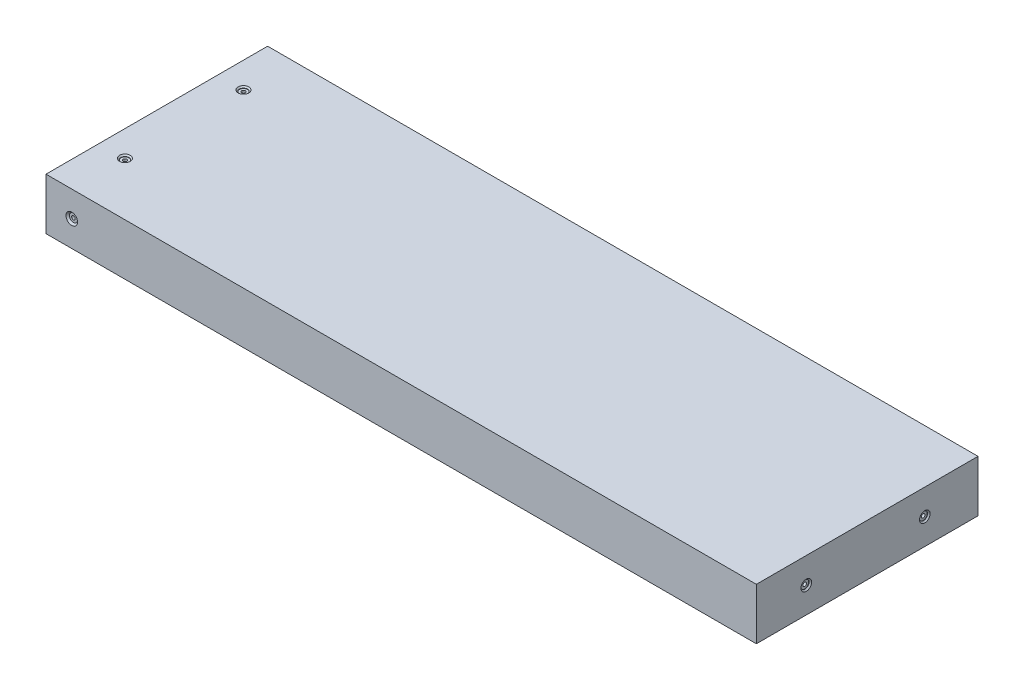
ISO-10303-21;
HEADER;
FILE_DESCRIPTION(('STEP AP214'),'2;1');
FILE_NAME('part.step','',(''),(''),'','','');
FILE_SCHEMA(('AUTOMOTIVE_DESIGN { 1 0 10303 214 1 1 1 1 }'));
ENDSEC;
DATA;
#1=APPLICATION_CONTEXT('core data for automotive mechanical design processes');
#2=APPLICATION_PROTOCOL_DEFINITION('international standard','automotive_design',2000,#1);
#3=PRODUCT_CONTEXT('',#1,'mechanical');
#4=PRODUCT('Part','Part','',(#3));
#5=PRODUCT_RELATED_PRODUCT_CATEGORY('part','',(#4));
#6=PRODUCT_DEFINITION_FORMATION('','',#4);
#7=PRODUCT_DEFINITION_CONTEXT('part definition',#1,'design');
#8=PRODUCT_DEFINITION('design','',#6,#7);
#9=PRODUCT_DEFINITION_SHAPE('','',#8);
#10=(LENGTH_UNIT() NAMED_UNIT(*) SI_UNIT(.MILLI.,.METRE.));
#11=(NAMED_UNIT(*) PLANE_ANGLE_UNIT() SI_UNIT($,.RADIAN.));
#12=(NAMED_UNIT(*) SI_UNIT($,.STERADIAN.) SOLID_ANGLE_UNIT());
#13=UNCERTAINTY_MEASURE_WITH_UNIT(LENGTH_MEASURE(1.E-05),#10,'distance_accuracy_value','');
#14=(GEOMETRIC_REPRESENTATION_CONTEXT(3) GLOBAL_UNCERTAINTY_ASSIGNED_CONTEXT((#13)) GLOBAL_UNIT_ASSIGNED_CONTEXT((#10,
#11,#12)) REPRESENTATION_CONTEXT('',''));
#15=CARTESIAN_POINT('',(0.,0.,0.));
#16=DIRECTION('',(0.,0.,1.));
#17=DIRECTION('',(1.,0.,0.));
#18=AXIS2_PLACEMENT_3D('',#15,#16,#17);
#19=CARTESIAN_POINT('',(-162.3,12.7,-54.6));
#20=DIRECTION('',(0.,0.,-1.));
#21=DIRECTION('',(-1.,0.,0.));
#22=AXIS2_PLACEMENT_3D('',#19,#20,#21);
#23=CYLINDRICAL_SURFACE('',#22,0.889000000000001);
#24=CARTESIAN_POINT('',(-162.3,12.7,-53.7872));
#25=DIRECTION('',(0.,0.,-1.));
#26=DIRECTION('',(-1.,0.,0.));
#27=AXIS2_PLACEMENT_3D('',#24,#25,#26);
#28=CIRCLE('',#27,0.889000000000001);
#29=CARTESIAN_POINT('',(-163.189,12.7,-53.7872));
#30=VERTEX_POINT('',#29);
#31=EDGE_CURVE('E169',#30,#30,#28,.T.);
#32=ORIENTED_EDGE('',*,*,#31,.T.);
#33=EDGE_LOOP('',(#32));
#34=FACE_BOUND('',#33,.T.);
#35=CARTESIAN_POINT('',(-162.3,12.7,-30.));
#36=DIRECTION('',(0.,-0.707106781186547,-0.707106781186547));
#37=DIRECTION('',(0.,0.707106781186547,-0.707106781186547));
#38=AXIS2_PLACEMENT_3D('',#35,#36,#37);
#39=ELLIPSE('',#38,1.25723585694968,0.889000000000001);
#40=CARTESIAN_POINT('',(-161.411,12.7,-30.));
#41=VERTEX_POINT('',#40);
#42=CARTESIAN_POINT('',(-163.189,12.7,-30.));
#43=VERTEX_POINT('',#42);
#44=EDGE_CURVE('E47',#41,#43,#39,.F.);
#45=ORIENTED_EDGE('',*,*,#44,.T.);
#46=CARTESIAN_POINT('',(-162.3,12.7,-30.));
#47=DIRECTION('',(0.,0.707106781186547,-0.707106781186547));
#48=DIRECTION('',(0.,-0.707106781186547,-0.707106781186547));
#49=AXIS2_PLACEMENT_3D('',#46,#47,#48);
#50=ELLIPSE('',#49,1.25723585694968,0.889000000000001);
#51=EDGE_CURVE('E11',#43,#41,#50,.F.);
#52=ORIENTED_EDGE('',*,*,#51,.T.);
#53=EDGE_LOOP('',(#45,#52));
#54=FACE_BOUND('',#53,.T.);
#55=ADVANCED_FACE('F34',(#34,#54),#23,.F.);
#56=CARTESIAN_POINT('',(-162.3,12.7,54.6));
#57=DIRECTION('',(0.,0.,1.));
#58=DIRECTION('',(1.,0.,0.));
#59=AXIS2_PLACEMENT_3D('',#56,#57,#58);
#60=CYLINDRICAL_SURFACE('',#59,0.889000000000001);
#61=CARTESIAN_POINT('',(-162.3,12.7,53.7872));
#62=DIRECTION('',(0.,0.,1.));
#63=DIRECTION('',(1.,0.,0.));
#64=AXIS2_PLACEMENT_3D('',#61,#62,#63);
#65=CIRCLE('',#64,0.889000000000001);
#66=CARTESIAN_POINT('',(-161.411,12.7,53.7872));
#67=VERTEX_POINT('',#66);
#68=EDGE_CURVE('E154',#67,#67,#65,.T.);
#69=ORIENTED_EDGE('',*,*,#68,.T.);
#70=EDGE_LOOP('',(#69));
#71=FACE_BOUND('',#70,.T.);
#72=CARTESIAN_POINT('',(-162.3,12.7,28.4));
#73=DIRECTION('',(0.,-0.707106781186547,0.707106781186547));
#74=DIRECTION('',(0.,0.707106781186547,0.707106781186547));
#75=AXIS2_PLACEMENT_3D('',#72,#73,#74);
#76=ELLIPSE('',#75,1.25723585694968,0.889000000000001);
#77=CARTESIAN_POINT('',(-163.189,12.7,28.4));
#78=VERTEX_POINT('',#77);
#79=CARTESIAN_POINT('',(-161.411,12.7,28.4));
#80=VERTEX_POINT('',#79);
#81=EDGE_CURVE('E54',#78,#80,#76,.F.);
#82=ORIENTED_EDGE('',*,*,#81,.T.);
#83=CARTESIAN_POINT('',(-162.3,12.7,28.4));
#84=DIRECTION('',(0.,0.707106781186547,0.707106781186547));
#85=DIRECTION('',(0.,-0.707106781186547,0.707106781186547));
#86=AXIS2_PLACEMENT_3D('',#83,#84,#85);
#87=ELLIPSE('',#86,1.25723585694968,0.889000000000001);
#88=EDGE_CURVE('E108',#80,#78,#87,.F.);
#89=ORIENTED_EDGE('',*,*,#88,.T.);
#90=EDGE_LOOP('',(#82,#89));
#91=FACE_BOUND('',#90,.T.);
#92=ADVANCED_FACE('F282',(#71,#91),#60,.F.);
#93=CARTESIAN_POINT('',(175.,25.4,-54.6));
#94=DIRECTION('',(-1.,0.,0.));
#95=DIRECTION('',(0.,0.,1.));
#96=AXIS2_PLACEMENT_3D('',#93,#94,#95);
#97=PLANE('',#96);
#98=CARTESIAN_POINT('',(175.,12.7,30.));
#99=DIRECTION('',(1.,0.,0.));
#100=DIRECTION('',(0.,0.,-1.));
#101=AXIS2_PLACEMENT_3D('',#98,#99,#100);
#102=CIRCLE('',#101,2.62001);
#103=CARTESIAN_POINT('',(175.,12.7,27.37999));
#104=VERTEX_POINT('',#103);
#105=EDGE_CURVE('E208',#104,#104,#102,.T.);
#106=ORIENTED_EDGE('',*,*,#105,.F.);
#107=EDGE_LOOP('',(#106));
#108=FACE_BOUND('',#107,.T.);
#109=CARTESIAN_POINT('',(175.,12.7,-28.4));
#110=DIRECTION('',(1.,0.,0.));
#111=DIRECTION('',(0.,0.,-1.));
#112=AXIS2_PLACEMENT_3D('',#109,#110,#111);
#113=CIRCLE('',#112,2.62001);
#114=CARTESIAN_POINT('',(175.,12.7,-31.02001));
#115=VERTEX_POINT('',#114);
#116=EDGE_CURVE('E193',#115,#115,#113,.T.);
#117=ORIENTED_EDGE('',*,*,#116,.F.);
#118=EDGE_LOOP('',(#117));
#119=FACE_BOUND('',#118,.T.);
#120=DIRECTION('',(0.,0.,-1.));
#121=VECTOR('',#120,1.);
#122=CARTESIAN_POINT('',(175.,0.,-54.6));
#123=LINE('',#122,#121);
#124=CARTESIAN_POINT('',(175.,0.,54.6));
#125=VERTEX_POINT('',#124);
#126=CARTESIAN_POINT('',(175.,0.,-54.6));
#127=VERTEX_POINT('',#126);
#128=EDGE_CURVE('E141',#125,#127,#123,.T.);
#129=ORIENTED_EDGE('',*,*,#128,.T.);
#130=DIRECTION('',(0.,-1.,0.));
#131=VECTOR('',#130,1.);
#132=CARTESIAN_POINT('',(175.,25.4,-54.6));
#133=LINE('',#132,#131);
#134=CARTESIAN_POINT('',(175.,25.4,-54.6));
#135=VERTEX_POINT('',#134);
#136=EDGE_CURVE('E121',#135,#127,#133,.T.);
#137=ORIENTED_EDGE('',*,*,#136,.F.);
#138=DIRECTION('',(0.,0.,-1.));
#139=VECTOR('',#138,1.);
#140=CARTESIAN_POINT('',(175.,25.4,-54.6));
#141=LINE('',#140,#139);
#142=CARTESIAN_POINT('',(175.,25.4,54.6));
#143=VERTEX_POINT('',#142);
#144=EDGE_CURVE('E136',#143,#135,#141,.T.);
#145=ORIENTED_EDGE('',*,*,#144,.F.);
#146=DIRECTION('',(0.,-1.,0.));
#147=VECTOR('',#146,1.);
#148=CARTESIAN_POINT('',(175.,25.4,54.6));
#149=LINE('',#148,#147);
#150=EDGE_CURVE('E130',#143,#125,#149,.T.);
#151=ORIENTED_EDGE('',*,*,#150,.T.);
#152=EDGE_LOOP('',(#129,#137,#145,#151));
#153=FACE_BOUND('',#152,.T.);
#154=ADVANCED_FACE('F36',(#108,#119,#153),#97,.F.);
#155=CARTESIAN_POINT('',(-175.,25.4,-54.6));
#156=DIRECTION('',(0.,0.,1.));
#157=DIRECTION('',(1.,0.,0.));
#158=AXIS2_PLACEMENT_3D('',#155,#156,#157);
#159=PLANE('',#158);
#160=CARTESIAN_POINT('',(-162.3,12.7,-54.6));
#161=DIRECTION('',(0.,0.,-1.));
#162=DIRECTION('',(-1.,0.,0.));
#163=AXIS2_PLACEMENT_3D('',#160,#161,#162);
#164=CIRCLE('',#163,2.85749999999998);
#165=CARTESIAN_POINT('',(-165.1575,12.7,-54.6));
#166=VERTEX_POINT('',#165);
#167=EDGE_CURVE('E178',#166,#166,#164,.T.);
#168=ORIENTED_EDGE('',*,*,#167,.F.);
#169=EDGE_LOOP('',(#168));
#170=FACE_BOUND('',#169,.T.);
#171=DIRECTION('',(-1.,0.,0.));
#172=VECTOR('',#171,1.);
#173=CARTESIAN_POINT('',(-175.,0.,-54.6));
#174=LINE('',#173,#172);
#175=CARTESIAN_POINT('',(-175.,0.,-54.6));
#176=VERTEX_POINT('',#175);
#177=EDGE_CURVE('E139',#127,#176,#174,.T.);
#178=ORIENTED_EDGE('',*,*,#177,.T.);
#179=DIRECTION('',(0.,-1.,0.));
#180=VECTOR('',#179,1.);
#181=CARTESIAN_POINT('',(-175.,25.4,-54.6));
#182=LINE('',#181,#180);
#183=CARTESIAN_POINT('',(-175.,25.4,-54.6));
#184=VERTEX_POINT('',#183);
#185=EDGE_CURVE('E124',#184,#176,#182,.T.);
#186=ORIENTED_EDGE('',*,*,#185,.F.);
#187=DIRECTION('',(-1.,0.,0.));
#188=VECTOR('',#187,1.);
#189=CARTESIAN_POINT('',(-175.,25.4,-54.6));
#190=LINE('',#189,#188);
#191=EDGE_CURVE('E148',#135,#184,#190,.T.);
#192=ORIENTED_EDGE('',*,*,#191,.F.);
#193=ORIENTED_EDGE('',*,*,#136,.T.);
#194=EDGE_LOOP('',(#178,#186,#192,#193));
#195=FACE_BOUND('',#194,.T.);
#196=ADVANCED_FACE('F260',(#170,#195),#159,.F.);
#197=CARTESIAN_POINT('',(-175.,25.4,-54.6));
#198=DIRECTION('',(1.,0.,0.));
#199=DIRECTION('',(0.,0.,-1.));
#200=AXIS2_PLACEMENT_3D('',#197,#198,#199);
#201=PLANE('',#200);
#202=DIRECTION('',(0.,0.,1.));
#203=VECTOR('',#202,1.);
#204=CARTESIAN_POINT('',(-175.,0.,-54.6));
#205=LINE('',#204,#203);
#206=CARTESIAN_POINT('',(-175.,0.,54.6));
#207=VERTEX_POINT('',#206);
#208=EDGE_CURVE('E137',#176,#207,#205,.T.);
#209=ORIENTED_EDGE('',*,*,#208,.T.);
#210=DIRECTION('',(0.,-1.,0.));
#211=VECTOR('',#210,1.);
#212=CARTESIAN_POINT('',(-175.,25.4,54.6));
#213=LINE('',#212,#211);
#214=CARTESIAN_POINT('',(-175.,25.4,54.6));
#215=VERTEX_POINT('',#214);
#216=EDGE_CURVE('E127',#215,#207,#213,.T.);
#217=ORIENTED_EDGE('',*,*,#216,.F.);
#218=DIRECTION('',(0.,0.,1.));
#219=VECTOR('',#218,1.);
#220=CARTESIAN_POINT('',(-175.,25.4,-54.6));
#221=LINE('',#220,#219);
#222=EDGE_CURVE('E146',#184,#215,#221,.T.);
#223=ORIENTED_EDGE('',*,*,#222,.F.);
#224=ORIENTED_EDGE('',*,*,#185,.T.);
#225=EDGE_LOOP('',(#209,#217,#223,#224));
#226=FACE_BOUND('',#225,.T.);
#227=ADVANCED_FACE('F265',(#226),#201,.F.);
#228=CARTESIAN_POINT('',(-175.,25.4,54.6));
#229=DIRECTION('',(0.,0.,-1.));
#230=DIRECTION('',(-1.,0.,0.));
#231=AXIS2_PLACEMENT_3D('',#228,#229,#230);
#232=PLANE('',#231);
#233=CARTESIAN_POINT('',(-162.3,12.7,54.6));
#234=DIRECTION('',(0.,0.,1.));
#235=DIRECTION('',(1.,0.,0.));
#236=AXIS2_PLACEMENT_3D('',#233,#234,#235);
#237=CIRCLE('',#236,2.85749999999998);
#238=CARTESIAN_POINT('',(-159.4425,12.7,54.6));
#239=VERTEX_POINT('',#238);
#240=EDGE_CURVE('E163',#239,#239,#237,.T.);
#241=ORIENTED_EDGE('',*,*,#240,.F.);
#242=EDGE_LOOP('',(#241));
#243=FACE_BOUND('',#242,.T.);
#244=DIRECTION('',(1.,0.,0.));
#245=VECTOR('',#244,1.);
#246=CARTESIAN_POINT('',(-175.,0.,54.6));
#247=LINE('',#246,#245);
#248=EDGE_CURVE('E134',#207,#125,#247,.T.);
#249=ORIENTED_EDGE('',*,*,#248,.T.);
#250=ORIENTED_EDGE('',*,*,#150,.F.);
#251=DIRECTION('',(1.,0.,0.));
#252=VECTOR('',#251,1.);
#253=CARTESIAN_POINT('',(-175.,25.4,54.6));
#254=LINE('',#253,#252);
#255=EDGE_CURVE('E133',#215,#143,#254,.T.);
#256=ORIENTED_EDGE('',*,*,#255,.F.);
#257=ORIENTED_EDGE('',*,*,#216,.T.);
#258=EDGE_LOOP('',(#249,#250,#256,#257));
#259=FACE_BOUND('',#258,.T.);
#260=ADVANCED_FACE('F248',(#243,#259),#232,.F.);
#261=CARTESIAN_POINT('',(0.,25.4,0.));
#262=DIRECTION('',(0.,1.,0.));
#263=DIRECTION('',(0.,0.,1.));
#264=AXIS2_PLACEMENT_3D('',#261,#262,#263);
#265=PLANE('',#264);
#266=CARTESIAN_POINT('',(-162.3,25.4,-30.));
#267=DIRECTION('',(0.,1.,0.));
#268=DIRECTION('',(0.,0.,1.));
#269=AXIS2_PLACEMENT_3D('',#266,#267,#268);
#270=CIRCLE('',#269,2.62001000000001);
#271=CARTESIAN_POINT('',(-162.3,25.4,-27.37999));
#272=VERTEX_POINT('',#271);
#273=EDGE_CURVE('E238',#272,#272,#270,.T.);
#274=ORIENTED_EDGE('',*,*,#273,.F.);
#275=EDGE_LOOP('',(#274));
#276=FACE_BOUND('',#275,.T.);
#277=CARTESIAN_POINT('',(-162.3,25.4,28.4));
#278=DIRECTION('',(0.,1.,0.));
#279=DIRECTION('',(0.,0.,1.));
#280=AXIS2_PLACEMENT_3D('',#277,#278,#279);
#281=CIRCLE('',#280,2.62001000000001);
#282=CARTESIAN_POINT('',(-162.3,25.4,31.02001));
#283=VERTEX_POINT('',#282);
#284=EDGE_CURVE('E223',#283,#283,#281,.T.);
#285=ORIENTED_EDGE('',*,*,#284,.F.);
#286=EDGE_LOOP('',(#285));
#287=FACE_BOUND('',#286,.T.);
#288=ORIENTED_EDGE('',*,*,#144,.T.);
#289=ORIENTED_EDGE('',*,*,#191,.T.);
#290=ORIENTED_EDGE('',*,*,#222,.T.);
#291=ORIENTED_EDGE('',*,*,#255,.T.);
#292=EDGE_LOOP('',(#288,#289,#290,#291));
#293=FACE_BOUND('',#292,.T.);
#294=ADVANCED_FACE('F244',(#276,#287,#293),#265,.T.);
#295=CARTESIAN_POINT('',(0.,0.,0.));
#296=DIRECTION('',(0.,1.,0.));
#297=DIRECTION('',(0.,0.,1.));
#298=AXIS2_PLACEMENT_3D('',#295,#296,#297);
#299=PLANE('',#298);
#300=CARTESIAN_POINT('',(-162.3,0.,-30.));
#301=DIRECTION('',(0.,1.,0.));
#302=DIRECTION('',(0.,0.,1.));
#303=AXIS2_PLACEMENT_3D('',#300,#301,#302);
#304=CIRCLE('',#303,0.889000000000001);
#305=CARTESIAN_POINT('',(-162.3,0.,-29.111));
#306=VERTEX_POINT('',#305);
#307=EDGE_CURVE('E226',#306,#306,#304,.T.);
#308=ORIENTED_EDGE('',*,*,#307,.T.);
#309=EDGE_LOOP('',(#308));
#310=FACE_BOUND('',#309,.T.);
#311=CARTESIAN_POINT('',(-162.3,0.,28.4));
#312=DIRECTION('',(0.,1.,0.));
#313=DIRECTION('',(0.,0.,1.));
#314=AXIS2_PLACEMENT_3D('',#311,#312,#313);
#315=CIRCLE('',#314,0.889000000000001);
#316=CARTESIAN_POINT('',(-162.3,0.,29.289));
#317=VERTEX_POINT('',#316);
#318=EDGE_CURVE('E211',#317,#317,#315,.T.);
#319=ORIENTED_EDGE('',*,*,#318,.T.);
#320=EDGE_LOOP('',(#319));
#321=FACE_BOUND('',#320,.T.);
#322=ORIENTED_EDGE('',*,*,#128,.F.);
#323=ORIENTED_EDGE('',*,*,#248,.F.);
#324=ORIENTED_EDGE('',*,*,#208,.F.);
#325=ORIENTED_EDGE('',*,*,#177,.F.);
#326=EDGE_LOOP('',(#322,#323,#324,#325));
#327=FACE_BOUND('',#326,.T.);
#328=ADVANCED_FACE('F247',(#310,#321,#327),#299,.F.);
#329=CARTESIAN_POINT('',(-161.411,12.7,53.7872));
#330=DIRECTION('',(0.,0.,-1.));
#331=DIRECTION('',(-1.,0.,0.));
#332=AXIS2_PLACEMENT_3D('',#329,#330,#331);
#333=PLANE('',#332);
#334=ORIENTED_EDGE('',*,*,#68,.F.);
#335=EDGE_LOOP('',(#334));
#336=FACE_BOUND('',#335,.T.);
#337=CARTESIAN_POINT('',(-162.3,12.7,53.7872));
#338=DIRECTION('',(0.,0.,1.));
#339=DIRECTION('',(1.,0.,0.));
#340=AXIS2_PLACEMENT_3D('',#337,#338,#339);
#341=CIRCLE('',#340,1.98500999999998);
#342=CARTESIAN_POINT('',(-160.31499,12.7,53.7872));
#343=VERTEX_POINT('',#342);
#344=EDGE_CURVE('E157',#343,#343,#341,.T.);
#345=ORIENTED_EDGE('',*,*,#344,.T.);
#346=EDGE_LOOP('',(#345));
#347=FACE_BOUND('',#346,.T.);
#348=ADVANCED_FACE('F270',(#336,#347),#333,.F.);
#349=CARTESIAN_POINT('',(-162.3,12.7,54.6));
#350=DIRECTION('',(0.,0.,1.));
#351=DIRECTION('',(1.,0.,0.));
#352=AXIS2_PLACEMENT_3D('',#349,#350,#351);
#353=CYLINDRICAL_SURFACE('',#352,1.98500999999998);
#354=ORIENTED_EDGE('',*,*,#344,.F.);
#355=EDGE_LOOP('',(#354));
#356=FACE_BOUND('',#355,.T.);
#357=CARTESIAN_POINT('',(-162.3,12.7,53.72751));
#358=DIRECTION('',(0.,0.,1.));
#359=DIRECTION('',(1.,0.,0.));
#360=AXIS2_PLACEMENT_3D('',#357,#358,#359);
#361=CIRCLE('',#360,1.98500999999998);
#362=CARTESIAN_POINT('',(-160.31499,12.7,53.72751));
#363=VERTEX_POINT('',#362);
#364=EDGE_CURVE('E160',#363,#363,#361,.T.);
#365=ORIENTED_EDGE('',*,*,#364,.T.);
#366=EDGE_LOOP('',(#365));
#367=FACE_BOUND('',#366,.T.);
#368=ADVANCED_FACE('F276',(#356,#367),#353,.T.);
#369=CARTESIAN_POINT('',(-162.3,12.7,54.6));
#370=DIRECTION('',(0.,0.,1.));
#371=DIRECTION('',(1.,0.,0.));
#372=AXIS2_PLACEMENT_3D('',#369,#370,#371);
#373=CONICAL_SURFACE('',#372,2.85749999999998,0.785398163397452);
#374=ORIENTED_EDGE('',*,*,#364,.F.);
#375=EDGE_LOOP('',(#374));
#376=FACE_BOUND('',#375,.T.);
#377=ORIENTED_EDGE('',*,*,#240,.T.);
#378=EDGE_LOOP('',(#377));
#379=FACE_BOUND('',#378,.T.);
#380=ADVANCED_FACE('F309',(#376,#379),#373,.F.);
#381=CARTESIAN_POINT('',(-161.411,12.7,-53.7872));
#382=DIRECTION('',(0.,0.,1.));
#383=DIRECTION('',(1.,0.,0.));
#384=AXIS2_PLACEMENT_3D('',#381,#382,#383);
#385=PLANE('',#384);
#386=ORIENTED_EDGE('',*,*,#31,.F.);
#387=EDGE_LOOP('',(#386));
#388=FACE_BOUND('',#387,.T.);
#389=CARTESIAN_POINT('',(-162.3,12.7,-53.7872));
#390=DIRECTION('',(0.,0.,-1.));
#391=DIRECTION('',(-1.,0.,0.));
#392=AXIS2_PLACEMENT_3D('',#389,#390,#391);
#393=CIRCLE('',#392,1.98500999999998);
#394=CARTESIAN_POINT('',(-164.28501,12.7,-53.7872));
#395=VERTEX_POINT('',#394);
#396=EDGE_CURVE('E172',#395,#395,#393,.T.);
#397=ORIENTED_EDGE('',*,*,#396,.T.);
#398=EDGE_LOOP('',(#397));
#399=FACE_BOUND('',#398,.T.);
#400=ADVANCED_FACE('F312',(#388,#399),#385,.F.);
#401=CARTESIAN_POINT('',(-162.3,12.7,-54.6));
#402=DIRECTION('',(0.,0.,-1.));
#403=DIRECTION('',(-1.,0.,0.));
#404=AXIS2_PLACEMENT_3D('',#401,#402,#403);
#405=CYLINDRICAL_SURFACE('',#404,1.98500999999998);
#406=ORIENTED_EDGE('',*,*,#396,.F.);
#407=EDGE_LOOP('',(#406));
#408=FACE_BOUND('',#407,.T.);
#409=CARTESIAN_POINT('',(-162.3,12.7,-53.72751));
#410=DIRECTION('',(0.,0.,-1.));
#411=DIRECTION('',(-1.,0.,0.));
#412=AXIS2_PLACEMENT_3D('',#409,#410,#411);
#413=CIRCLE('',#412,1.98500999999998);
#414=CARTESIAN_POINT('',(-164.28501,12.7,-53.72751));
#415=VERTEX_POINT('',#414);
#416=EDGE_CURVE('E175',#415,#415,#413,.T.);
#417=ORIENTED_EDGE('',*,*,#416,.T.);
#418=EDGE_LOOP('',(#417));
#419=FACE_BOUND('',#418,.T.);
#420=ADVANCED_FACE('F394',(#408,#419),#405,.T.);
#421=CARTESIAN_POINT('',(-162.3,12.7,-54.6));
#422=DIRECTION('',(0.,0.,-1.));
#423=DIRECTION('',(-1.,0.,0.));
#424=AXIS2_PLACEMENT_3D('',#421,#422,#423);
#425=CONICAL_SURFACE('',#424,2.85749999999998,0.785398163397452);
#426=ORIENTED_EDGE('',*,*,#416,.F.);
#427=EDGE_LOOP('',(#426));
#428=FACE_BOUND('',#427,.T.);
#429=ORIENTED_EDGE('',*,*,#167,.T.);
#430=EDGE_LOOP('',(#429));
#431=FACE_BOUND('',#430,.T.);
#432=ADVANCED_FACE('F390',(#428,#431),#425,.F.);
#433=CARTESIAN_POINT('',(145.,12.7,-28.4));
#434=DIRECTION('',(1.,0.,0.));
#435=DIRECTION('',(0.,0.,-1.));
#436=AXIS2_PLACEMENT_3D('',#433,#434,#435);
#437=CONICAL_SURFACE('',#436,0.888999999999992,1.02974425867664);
#438=CARTESIAN_POINT('',(144.465834909684,12.7,-28.4));
#439=VERTEX_POINT('',#438);
#440=VERTEX_LOOP('',#439);
#441=FACE_BOUND('',#440,.T.);
#442=CARTESIAN_POINT('',(145.,12.7,-28.4));
#443=DIRECTION('',(1.,0.,0.));
#444=DIRECTION('',(0.,0.,-1.));
#445=AXIS2_PLACEMENT_3D('',#442,#443,#444);
#446=CIRCLE('',#445,0.888999999999992);
#447=CARTESIAN_POINT('',(145.,12.7,-29.289));
#448=VERTEX_POINT('',#447);
#449=EDGE_CURVE('E181',#448,#448,#446,.T.);
#450=ORIENTED_EDGE('',*,*,#449,.T.);
#451=EDGE_LOOP('',(#450));
#452=FACE_BOUND('',#451,.T.);
#453=ADVANCED_FACE('F386',(#441,#452),#437,.F.);
#454=CARTESIAN_POINT('',(175.,12.7,-28.4));
#455=DIRECTION('',(1.,0.,0.));
#456=DIRECTION('',(0.,0.,-1.));
#457=AXIS2_PLACEMENT_3D('',#454,#455,#456);
#458=CYLINDRICAL_SURFACE('',#457,0.888999999999994);
#459=ORIENTED_EDGE('',*,*,#449,.F.);
#460=EDGE_LOOP('',(#459));
#461=FACE_BOUND('',#460,.T.);
#462=CARTESIAN_POINT('',(174.1872,12.7,-28.4));
#463=DIRECTION('',(1.,0.,0.));
#464=DIRECTION('',(0.,0.,-1.));
#465=AXIS2_PLACEMENT_3D('',#462,#463,#464);
#466=CIRCLE('',#465,0.888999999999996);
#467=CARTESIAN_POINT('',(174.1872,12.7,-29.289));
#468=VERTEX_POINT('',#467);
#469=EDGE_CURVE('E184',#468,#468,#466,.T.);
#470=ORIENTED_EDGE('',*,*,#469,.T.);
#471=EDGE_LOOP('',(#470));
#472=FACE_BOUND('',#471,.T.);
#473=ADVANCED_FACE('F382',(#461,#472),#458,.F.);
#474=CARTESIAN_POINT('',(174.1872,13.589,-28.4));
#475=DIRECTION('',(-1.,0.,0.));
#476=DIRECTION('',(0.,0.,1.));
#477=AXIS2_PLACEMENT_3D('',#474,#475,#476);
#478=PLANE('',#477);
#479=ORIENTED_EDGE('',*,*,#469,.F.);
#480=EDGE_LOOP('',(#479));
#481=FACE_BOUND('',#480,.T.);
#482=CARTESIAN_POINT('',(174.1872,12.7,-28.4));
#483=DIRECTION('',(1.,0.,0.));
#484=DIRECTION('',(0.,0.,-1.));
#485=AXIS2_PLACEMENT_3D('',#482,#483,#484);
#486=CIRCLE('',#485,1.98501);
#487=CARTESIAN_POINT('',(174.1872,12.7,-30.38501));
#488=VERTEX_POINT('',#487);
#489=EDGE_CURVE('E187',#488,#488,#486,.T.);
#490=ORIENTED_EDGE('',*,*,#489,.T.);
#491=EDGE_LOOP('',(#490));
#492=FACE_BOUND('',#491,.T.);
#493=ADVANCED_FACE('F378',(#481,#492),#478,.F.);
#494=CARTESIAN_POINT('',(175.,12.7,-28.4));
#495=DIRECTION('',(1.,0.,0.));
#496=DIRECTION('',(0.,0.,-1.));
#497=AXIS2_PLACEMENT_3D('',#494,#495,#496);
#498=CYLINDRICAL_SURFACE('',#497,1.98501);
#499=ORIENTED_EDGE('',*,*,#489,.F.);
#500=EDGE_LOOP('',(#499));
#501=FACE_BOUND('',#500,.T.);
#502=CARTESIAN_POINT('',(174.365,12.7,-28.4));
#503=DIRECTION('',(1.,0.,0.));
#504=DIRECTION('',(0.,0.,-1.));
#505=AXIS2_PLACEMENT_3D('',#502,#503,#504);
#506=CIRCLE('',#505,1.98501);
#507=CARTESIAN_POINT('',(174.365,12.7,-30.38501));
#508=VERTEX_POINT('',#507);
#509=EDGE_CURVE('E190',#508,#508,#506,.T.);
#510=ORIENTED_EDGE('',*,*,#509,.T.);
#511=EDGE_LOOP('',(#510));
#512=FACE_BOUND('',#511,.T.);
#513=ADVANCED_FACE('F374',(#501,#512),#498,.F.);
#514=CARTESIAN_POINT('',(175.,12.7,-28.4));
#515=DIRECTION('',(1.,0.,0.));
#516=DIRECTION('',(0.,0.,-1.));
#517=AXIS2_PLACEMENT_3D('',#514,#515,#516);
#518=CONICAL_SURFACE('',#517,2.62001,0.785398163397451);
#519=ORIENTED_EDGE('',*,*,#509,.F.);
#520=EDGE_LOOP('',(#519));
#521=FACE_BOUND('',#520,.T.);
#522=ORIENTED_EDGE('',*,*,#116,.T.);
#523=EDGE_LOOP('',(#522));
#524=FACE_BOUND('',#523,.T.);
#525=ADVANCED_FACE('F370',(#521,#524),#518,.F.);
#526=CARTESIAN_POINT('',(145.,12.7,30.));
#527=DIRECTION('',(1.,0.,0.));
#528=DIRECTION('',(0.,0.,-1.));
#529=AXIS2_PLACEMENT_3D('',#526,#527,#528);
#530=CONICAL_SURFACE('',#529,0.888999999999992,1.02974425867664);
#531=CARTESIAN_POINT('',(144.465834909684,12.7,30.));
#532=VERTEX_POINT('',#531);
#533=VERTEX_LOOP('',#532);
#534=FACE_BOUND('',#533,.T.);
#535=CARTESIAN_POINT('',(145.,12.7,30.));
#536=DIRECTION('',(1.,0.,0.));
#537=DIRECTION('',(0.,0.,-1.));
#538=AXIS2_PLACEMENT_3D('',#535,#536,#537);
#539=CIRCLE('',#538,0.888999999999992);
#540=CARTESIAN_POINT('',(145.,12.7,29.111));
#541=VERTEX_POINT('',#540);
#542=EDGE_CURVE('E196',#541,#541,#539,.T.);
#543=ORIENTED_EDGE('',*,*,#542,.T.);
#544=EDGE_LOOP('',(#543));
#545=FACE_BOUND('',#544,.T.);
#546=ADVANCED_FACE('F366',(#534,#545),#530,.F.);
#547=CARTESIAN_POINT('',(175.,12.7,30.));
#548=DIRECTION('',(1.,0.,0.));
#549=DIRECTION('',(0.,0.,-1.));
#550=AXIS2_PLACEMENT_3D('',#547,#548,#549);
#551=CYLINDRICAL_SURFACE('',#550,0.888999999999994);
#552=ORIENTED_EDGE('',*,*,#542,.F.);
#553=EDGE_LOOP('',(#552));
#554=FACE_BOUND('',#553,.T.);
#555=CARTESIAN_POINT('',(174.1872,12.7,30.));
#556=DIRECTION('',(1.,0.,0.));
#557=DIRECTION('',(0.,0.,-1.));
#558=AXIS2_PLACEMENT_3D('',#555,#556,#557);
#559=CIRCLE('',#558,0.888999999999996);
#560=CARTESIAN_POINT('',(174.1872,12.7,29.111));
#561=VERTEX_POINT('',#560);
#562=EDGE_CURVE('E199',#561,#561,#559,.T.);
#563=ORIENTED_EDGE('',*,*,#562,.T.);
#564=EDGE_LOOP('',(#563));
#565=FACE_BOUND('',#564,.T.);
#566=ADVANCED_FACE('F362',(#554,#565),#551,.F.);
#567=CARTESIAN_POINT('',(174.1872,13.589,30.));
#568=DIRECTION('',(-1.,0.,0.));
#569=DIRECTION('',(0.,0.,1.));
#570=AXIS2_PLACEMENT_3D('',#567,#568,#569);
#571=PLANE('',#570);
#572=ORIENTED_EDGE('',*,*,#562,.F.);
#573=EDGE_LOOP('',(#572));
#574=FACE_BOUND('',#573,.T.);
#575=CARTESIAN_POINT('',(174.1872,12.7,30.));
#576=DIRECTION('',(1.,0.,0.));
#577=DIRECTION('',(0.,0.,-1.));
#578=AXIS2_PLACEMENT_3D('',#575,#576,#577);
#579=CIRCLE('',#578,1.98501);
#580=CARTESIAN_POINT('',(174.1872,12.7,28.01499));
#581=VERTEX_POINT('',#580);
#582=EDGE_CURVE('E202',#581,#581,#579,.T.);
#583=ORIENTED_EDGE('',*,*,#582,.T.);
#584=EDGE_LOOP('',(#583));
#585=FACE_BOUND('',#584,.T.);
#586=ADVANCED_FACE('F358',(#574,#585),#571,.F.);
#587=CARTESIAN_POINT('',(175.,12.7,30.));
#588=DIRECTION('',(1.,0.,0.));
#589=DIRECTION('',(0.,0.,-1.));
#590=AXIS2_PLACEMENT_3D('',#587,#588,#589);
#591=CYLINDRICAL_SURFACE('',#590,1.98501);
#592=ORIENTED_EDGE('',*,*,#582,.F.);
#593=EDGE_LOOP('',(#592));
#594=FACE_BOUND('',#593,.T.);
#595=CARTESIAN_POINT('',(174.365,12.7,30.));
#596=DIRECTION('',(1.,0.,0.));
#597=DIRECTION('',(0.,0.,-1.));
#598=AXIS2_PLACEMENT_3D('',#595,#596,#597);
#599=CIRCLE('',#598,1.98501);
#600=CARTESIAN_POINT('',(174.365,12.7,28.01499));
#601=VERTEX_POINT('',#600);
#602=EDGE_CURVE('E205',#601,#601,#599,.T.);
#603=ORIENTED_EDGE('',*,*,#602,.T.);
#604=EDGE_LOOP('',(#603));
#605=FACE_BOUND('',#604,.T.);
#606=ADVANCED_FACE('F354',(#594,#605),#591,.F.);
#607=CARTESIAN_POINT('',(175.,12.7,30.));
#608=DIRECTION('',(1.,0.,0.));
#609=DIRECTION('',(0.,0.,-1.));
#610=AXIS2_PLACEMENT_3D('',#607,#608,#609);
#611=CONICAL_SURFACE('',#610,2.62001,0.785398163397451);
#612=ORIENTED_EDGE('',*,*,#602,.F.);
#613=EDGE_LOOP('',(#612));
#614=FACE_BOUND('',#613,.T.);
#615=ORIENTED_EDGE('',*,*,#105,.T.);
#616=EDGE_LOOP('',(#615));
#617=FACE_BOUND('',#616,.T.);
#618=ADVANCED_FACE('F346',(#614,#617),#611,.F.);
#619=CARTESIAN_POINT('',(-161.411,24.5872,28.4));
#620=DIRECTION('',(0.,-1.,0.));
#621=DIRECTION('',(0.,0.,-1.));
#622=AXIS2_PLACEMENT_3D('',#619,#620,#621);
#623=PLANE('',#622);
#624=CARTESIAN_POINT('',(-162.3,24.5872,28.4));
#625=DIRECTION('',(0.,1.,0.));
#626=DIRECTION('',(0.,0.,1.));
#627=AXIS2_PLACEMENT_3D('',#624,#625,#626);
#628=CIRCLE('',#627,0.889000000000001);
#629=CARTESIAN_POINT('',(-162.3,24.5872,29.289));
#630=VERTEX_POINT('',#629);
#631=EDGE_CURVE('E214',#630,#630,#628,.T.);
#632=ORIENTED_EDGE('',*,*,#631,.F.);
#633=EDGE_LOOP('',(#632));
#634=FACE_BOUND('',#633,.T.);
#635=CARTESIAN_POINT('',(-162.3,24.5872,28.4));
#636=DIRECTION('',(0.,1.,0.));
#637=DIRECTION('',(0.,0.,1.));
#638=AXIS2_PLACEMENT_3D('',#635,#636,#637);
#639=CIRCLE('',#638,1.98500999999998);
#640=CARTESIAN_POINT('',(-162.3,24.5872,30.38501));
#641=VERTEX_POINT('',#640);
#642=EDGE_CURVE('E217',#641,#641,#639,.T.);
#643=ORIENTED_EDGE('',*,*,#642,.T.);
#644=EDGE_LOOP('',(#643));
#645=FACE_BOUND('',#644,.T.);
#646=ADVANCED_FACE('F343',(#634,#645),#623,.F.);
#647=CARTESIAN_POINT('',(-162.3,25.4,28.4));
#648=DIRECTION('',(0.,1.,0.));
#649=DIRECTION('',(0.,0.,1.));
#650=AXIS2_PLACEMENT_3D('',#647,#648,#649);
#651=CYLINDRICAL_SURFACE('',#650,0.889000000000001);
#652=ORIENTED_EDGE('',*,*,#631,.T.);
#653=EDGE_LOOP('',(#652));
#654=FACE_BOUND('',#653,.T.);
#655=ORIENTED_EDGE('',*,*,#81,.F.);
#656=CARTESIAN_POINT('',(-162.3,12.7,28.4));
#657=DIRECTION('',(0.,0.707106781186547,0.707106781186547));
#658=DIRECTION('',(0.,-0.707106781186547,0.707106781186547));
#659=AXIS2_PLACEMENT_3D('',#656,#657,#658);
#660=ELLIPSE('',#659,1.25723585694968,0.889000000000001);
#661=EDGE_CURVE('E114',#80,#78,#660,.T.);
#662=ORIENTED_EDGE('',*,*,#661,.F.);
#663=EDGE_LOOP('',(#655,#662));
#664=FACE_BOUND('',#663,.T.);
#665=ADVANCED_FACE('F336',(#654,#664),#651,.F.);
#666=CARTESIAN_POINT('',(-162.3,25.4,28.4));
#667=DIRECTION('',(0.,1.,0.));
#668=DIRECTION('',(0.,0.,1.));
#669=AXIS2_PLACEMENT_3D('',#666,#667,#668);
#670=CYLINDRICAL_SURFACE('',#669,1.98500999999998);
#671=ORIENTED_EDGE('',*,*,#642,.F.);
#672=EDGE_LOOP('',(#671));
#673=FACE_BOUND('',#672,.T.);
#674=CARTESIAN_POINT('',(-162.3,24.765,28.4));
#675=DIRECTION('',(0.,1.,0.));
#676=DIRECTION('',(0.,0.,1.));
#677=AXIS2_PLACEMENT_3D('',#674,#675,#676);
#678=CIRCLE('',#677,1.98500999999998);
#679=CARTESIAN_POINT('',(-162.3,24.765,30.38501));
#680=VERTEX_POINT('',#679);
#681=EDGE_CURVE('E220',#680,#680,#678,.T.);
#682=ORIENTED_EDGE('',*,*,#681,.T.);
#683=EDGE_LOOP('',(#682));
#684=FACE_BOUND('',#683,.T.);
#685=ADVANCED_FACE('F327',(#673,#684),#670,.F.);
#686=CARTESIAN_POINT('',(-162.3,25.4,28.4));
#687=DIRECTION('',(0.,1.,0.));
#688=DIRECTION('',(0.,0.,1.));
#689=AXIS2_PLACEMENT_3D('',#686,#687,#688);
#690=CONICAL_SURFACE('',#689,2.62001000000001,0.78539816339747);
#691=ORIENTED_EDGE('',*,*,#681,.F.);
#692=EDGE_LOOP('',(#691));
#693=FACE_BOUND('',#692,.T.);
#694=ORIENTED_EDGE('',*,*,#284,.T.);
#695=EDGE_LOOP('',(#694));
#696=FACE_BOUND('',#695,.T.);
#697=ADVANCED_FACE('F322',(#693,#696),#690,.F.);
#698=CARTESIAN_POINT('',(-162.3,12.7,24.6));
#699=DIRECTION('',(0.,0.,1.));
#700=DIRECTION('',(1.,0.,0.));
#701=AXIS2_PLACEMENT_3D('',#698,#699,#700);
#702=CONICAL_SURFACE('',#701,0.889000000000001,1.02974425867665);
#703=CARTESIAN_POINT('',(-162.3,12.7,24.0658349096845));
#704=VERTEX_POINT('',#703);
#705=VERTEX_LOOP('',#704);
#706=FACE_BOUND('',#705,.T.);
#707=CARTESIAN_POINT('',(-162.3,12.7,24.6));
#708=DIRECTION('',(0.,0.,1.));
#709=DIRECTION('',(1.,0.,0.));
#710=AXIS2_PLACEMENT_3D('',#707,#708,#709);
#711=CIRCLE('',#710,0.889000000000001);
#712=CARTESIAN_POINT('',(-161.411,12.7,24.6));
#713=VERTEX_POINT('',#712);
#714=EDGE_CURVE('E144',#713,#713,#711,.T.);
#715=ORIENTED_EDGE('',*,*,#714,.T.);
#716=EDGE_LOOP('',(#715));
#717=FACE_BOUND('',#716,.T.);
#718=ADVANCED_FACE('F319',(#706,#717),#702,.F.);
#719=CARTESIAN_POINT('',(-162.3,12.7,28.4));
#720=DIRECTION('',(0.,-0.707106781186547,0.707106781186547));
#721=DIRECTION('',(0.,0.707106781186547,0.707106781186547));
#722=AXIS2_PLACEMENT_3D('',#719,#720,#721);
#723=ELLIPSE('',#722,1.25723585694968,0.889000000000001);
#724=EDGE_CURVE('E117',#78,#80,#723,.T.);
#725=ORIENTED_EDGE('',*,*,#724,.T.);
#726=ORIENTED_EDGE('',*,*,#661,.T.);
#727=EDGE_LOOP('',(#725,#726));
#728=FACE_BOUND('',#727,.T.);
#729=ORIENTED_EDGE('',*,*,#714,.F.);
#730=EDGE_LOOP('',(#729));
#731=FACE_BOUND('',#730,.T.);
#732=ADVANCED_FACE('F290',(#728,#731),#60,.F.);
#733=ORIENTED_EDGE('',*,*,#724,.F.);
#734=ORIENTED_EDGE('',*,*,#88,.F.);
#735=EDGE_LOOP('',(#733,#734));
#736=FACE_BOUND('',#735,.T.);
#737=ORIENTED_EDGE('',*,*,#318,.F.);
#738=EDGE_LOOP('',(#737));
#739=FACE_BOUND('',#738,.T.);
#740=ADVANCED_FACE('F318',(#736,#739),#651,.F.);
#741=CARTESIAN_POINT('',(-161.411,24.5872,-30.));
#742=DIRECTION('',(0.,-1.,0.));
#743=DIRECTION('',(0.,0.,-1.));
#744=AXIS2_PLACEMENT_3D('',#741,#742,#743);
#745=PLANE('',#744);
#746=CARTESIAN_POINT('',(-162.3,24.5872,-30.));
#747=DIRECTION('',(0.,1.,0.));
#748=DIRECTION('',(0.,0.,1.));
#749=AXIS2_PLACEMENT_3D('',#746,#747,#748);
#750=CIRCLE('',#749,0.889000000000001);
#751=CARTESIAN_POINT('',(-162.3,24.5872,-29.111));
#752=VERTEX_POINT('',#751);
#753=EDGE_CURVE('E229',#752,#752,#750,.T.);
#754=ORIENTED_EDGE('',*,*,#753,.F.);
#755=EDGE_LOOP('',(#754));
#756=FACE_BOUND('',#755,.T.);
#757=CARTESIAN_POINT('',(-162.3,24.5872,-30.));
#758=DIRECTION('',(0.,1.,0.));
#759=DIRECTION('',(0.,0.,1.));
#760=AXIS2_PLACEMENT_3D('',#757,#758,#759);
#761=CIRCLE('',#760,1.98500999999998);
#762=CARTESIAN_POINT('',(-162.3,24.5872,-28.01499));
#763=VERTEX_POINT('',#762);
#764=EDGE_CURVE('E232',#763,#763,#761,.T.);
#765=ORIENTED_EDGE('',*,*,#764,.T.);
#766=EDGE_LOOP('',(#765));
#767=FACE_BOUND('',#766,.T.);
#768=ADVANCED_FACE('F350',(#756,#767),#745,.F.);
#769=CARTESIAN_POINT('',(-162.3,25.4,-30.));
#770=DIRECTION('',(0.,1.,0.));
#771=DIRECTION('',(0.,0.,1.));
#772=AXIS2_PLACEMENT_3D('',#769,#770,#771);
#773=CYLINDRICAL_SURFACE('',#772,0.889000000000001);
#774=ORIENTED_EDGE('',*,*,#753,.T.);
#775=EDGE_LOOP('',(#774));
#776=FACE_BOUND('',#775,.T.);
#777=ORIENTED_EDGE('',*,*,#44,.F.);
#778=CARTESIAN_POINT('',(-162.3,12.7,-30.));
#779=DIRECTION('',(0.,0.707106781186547,-0.707106781186547));
#780=DIRECTION('',(0.,-0.707106781186547,-0.707106781186547));
#781=AXIS2_PLACEMENT_3D('',#778,#779,#780);
#782=ELLIPSE('',#781,1.25723585694968,0.889000000000001);
#783=EDGE_CURVE('E42',#43,#41,#782,.T.);
#784=ORIENTED_EDGE('',*,*,#783,.F.);
#785=EDGE_LOOP('',(#777,#784));
#786=FACE_BOUND('',#785,.T.);
#787=ADVANCED_FACE('F107',(#776,#786),#773,.F.);
#788=CARTESIAN_POINT('',(-162.3,25.4,-30.));
#789=DIRECTION('',(0.,1.,0.));
#790=DIRECTION('',(0.,0.,1.));
#791=AXIS2_PLACEMENT_3D('',#788,#789,#790);
#792=CYLINDRICAL_SURFACE('',#791,1.98500999999998);
#793=ORIENTED_EDGE('',*,*,#764,.F.);
#794=EDGE_LOOP('',(#793));
#795=FACE_BOUND('',#794,.T.);
#796=CARTESIAN_POINT('',(-162.3,24.765,-30.));
#797=DIRECTION('',(0.,1.,0.));
#798=DIRECTION('',(0.,0.,1.));
#799=AXIS2_PLACEMENT_3D('',#796,#797,#798);
#800=CIRCLE('',#799,1.98500999999998);
#801=CARTESIAN_POINT('',(-162.3,24.765,-28.01499));
#802=VERTEX_POINT('',#801);
#803=EDGE_CURVE('E235',#802,#802,#800,.T.);
#804=ORIENTED_EDGE('',*,*,#803,.T.);
#805=EDGE_LOOP('',(#804));
#806=FACE_BOUND('',#805,.T.);
#807=ADVANCED_FACE('F304',(#795,#806),#792,.F.);
#808=CARTESIAN_POINT('',(-162.3,25.4,-30.));
#809=DIRECTION('',(0.,1.,0.));
#810=DIRECTION('',(0.,0.,1.));
#811=AXIS2_PLACEMENT_3D('',#808,#809,#810);
#812=CONICAL_SURFACE('',#811,2.62001000000001,0.78539816339747);
#813=ORIENTED_EDGE('',*,*,#803,.F.);
#814=EDGE_LOOP('',(#813));
#815=FACE_BOUND('',#814,.T.);
#816=ORIENTED_EDGE('',*,*,#273,.T.);
#817=EDGE_LOOP('',(#816));
#818=FACE_BOUND('',#817,.T.);
#819=ADVANCED_FACE('F242',(#815,#818),#812,.F.);
#820=CARTESIAN_POINT('',(-162.3,12.7,-24.6));
#821=DIRECTION('',(0.,0.,-1.));
#822=DIRECTION('',(-1.,0.,0.));
#823=AXIS2_PLACEMENT_3D('',#820,#821,#822);
#824=CONICAL_SURFACE('',#823,0.889000000000001,1.02974425867665);
#825=CARTESIAN_POINT('',(-162.3,12.7,-24.0658349096845));
#826=VERTEX_POINT('',#825);
#827=VERTEX_LOOP('',#826);
#828=FACE_BOUND('',#827,.T.);
#829=CARTESIAN_POINT('',(-162.3,12.7,-24.6));
#830=DIRECTION('',(0.,0.,-1.));
#831=DIRECTION('',(-1.,0.,0.));
#832=AXIS2_PLACEMENT_3D('',#829,#830,#831);
#833=CIRCLE('',#832,0.889000000000001);
#834=CARTESIAN_POINT('',(-163.189,12.7,-24.6));
#835=VERTEX_POINT('',#834);
#836=EDGE_CURVE('E166',#835,#835,#833,.T.);
#837=ORIENTED_EDGE('',*,*,#836,.T.);
#838=EDGE_LOOP('',(#837));
#839=FACE_BOUND('',#838,.T.);
#840=ADVANCED_FACE('F294',(#828,#839),#824,.F.);
#841=CARTESIAN_POINT('',(-162.3,12.7,-30.));
#842=DIRECTION('',(0.,-0.707106781186547,-0.707106781186547));
#843=DIRECTION('',(0.,0.707106781186547,-0.707106781186547));
#844=AXIS2_PLACEMENT_3D('',#841,#842,#843);
#845=ELLIPSE('',#844,1.25723585694968,0.889000000000001);
#846=EDGE_CURVE('E100',#41,#43,#845,.T.);
#847=ORIENTED_EDGE('',*,*,#846,.T.);
#848=ORIENTED_EDGE('',*,*,#783,.T.);
#849=EDGE_LOOP('',(#847,#848));
#850=FACE_BOUND('',#849,.T.);
#851=ORIENTED_EDGE('',*,*,#836,.F.);
#852=EDGE_LOOP('',(#851));
#853=FACE_BOUND('',#852,.T.);
#854=ADVANCED_FACE('F110',(#850,#853),#23,.F.);
#855=ORIENTED_EDGE('',*,*,#846,.F.);
#856=ORIENTED_EDGE('',*,*,#51,.F.);
#857=EDGE_LOOP('',(#855,#856));
#858=FACE_BOUND('',#857,.T.);
#859=ORIENTED_EDGE('',*,*,#307,.F.);
#860=EDGE_LOOP('',(#859));
#861=FACE_BOUND('',#860,.T.);
#862=ADVANCED_FACE('F101',(#858,#861),#773,.F.);
#863=CLOSED_SHELL('',(#55,#92,#154,#196,#227,#260,#294,#328,#348,#368,#380,#400,#420,#432,#453,
#473,#493,#513,#525,#546,#566,#586,#606,#618,#646,#665,#685,#697,#718,#732,#740,#768,#787,#807,
#819,#840,#854,#862));
#864=MANIFOLD_SOLID_BREP('B2',#863);
#865=ADVANCED_BREP_SHAPE_REPRESENTATION('',(#18,#864),#14);
#866=SHAPE_DEFINITION_REPRESENTATION(#9,#865);
ENDSEC;
END-ISO-10303-21;
